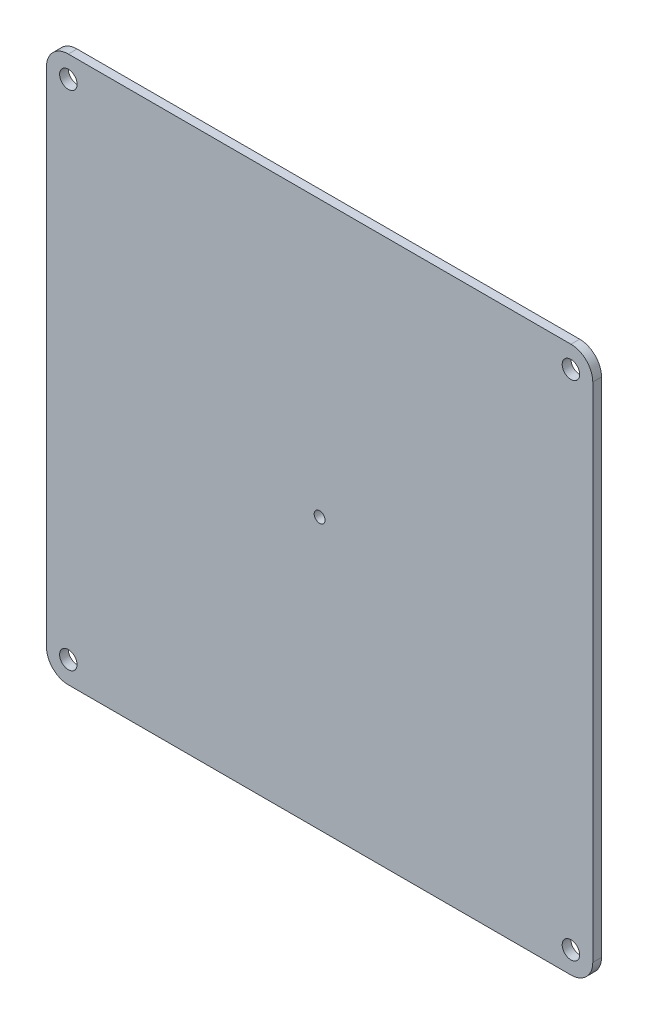
ISO-10303-21;
HEADER;
FILE_DESCRIPTION(('STEP AP214'),'2;1');
FILE_NAME('part.step','',(''),(''),'','','');
FILE_SCHEMA(('AUTOMOTIVE_DESIGN { 1 0 10303 214 1 1 1 1 }'));
ENDSEC;
DATA;
#1=APPLICATION_CONTEXT('core data for automotive mechanical design processes');
#2=APPLICATION_PROTOCOL_DEFINITION('international standard','automotive_design',2000,#1);
#3=PRODUCT_CONTEXT('',#1,'mechanical');
#4=PRODUCT('Part','Part','',(#3));
#5=PRODUCT_RELATED_PRODUCT_CATEGORY('part','',(#4));
#6=PRODUCT_DEFINITION_FORMATION('','',#4);
#7=PRODUCT_DEFINITION_CONTEXT('part definition',#1,'design');
#8=PRODUCT_DEFINITION('design','',#6,#7);
#9=PRODUCT_DEFINITION_SHAPE('','',#8);
#10=(LENGTH_UNIT() NAMED_UNIT(*) SI_UNIT(.MILLI.,.METRE.));
#11=(NAMED_UNIT(*) PLANE_ANGLE_UNIT() SI_UNIT($,.RADIAN.));
#12=(NAMED_UNIT(*) SI_UNIT($,.STERADIAN.) SOLID_ANGLE_UNIT());
#13=UNCERTAINTY_MEASURE_WITH_UNIT(LENGTH_MEASURE(1.E-05),#10,'distance_accuracy_value','');
#14=(GEOMETRIC_REPRESENTATION_CONTEXT(3) GLOBAL_UNCERTAINTY_ASSIGNED_CONTEXT((#13)) GLOBAL_UNIT_ASSIGNED_CONTEXT((#10,
#11,#12)) REPRESENTATION_CONTEXT('',''));
#15=CARTESIAN_POINT('',(0.,0.,0.));
#16=DIRECTION('',(0.,0.,1.));
#17=DIRECTION('',(1.,0.,0.));
#18=AXIS2_PLACEMENT_3D('',#15,#16,#17);
#19=CARTESIAN_POINT('',(46.0000000000003,46.0000000000005,1.6));
#20=DIRECTION('',(0.,0.,1.));
#21=DIRECTION('',(1.,0.,0.));
#22=AXIS2_PLACEMENT_3D('',#19,#20,#21);
#23=PLANE('',#22);
#24=CARTESIAN_POINT('',(45.9999999999998,-46.0000000000003,1.6));
#25=DIRECTION('',(0.,0.,1.));
#26=DIRECTION('',(1.,0.,0.));
#27=AXIS2_PLACEMENT_3D('',#24,#25,#26);
#28=CIRCLE('',#27,1.60000000000014);
#29=CARTESIAN_POINT('',(47.6,-46.0000000000003,1.6));
#30=VERTEX_POINT('',#29);
#31=EDGE_CURVE('E193',#30,#30,#28,.T.);
#32=ORIENTED_EDGE('',*,*,#31,.F.);
#33=EDGE_LOOP('',(#32));
#34=FACE_BOUND('',#33,.T.);
#35=CARTESIAN_POINT('',(0.,-0.4,1.6));
#36=DIRECTION('',(0.,0.,1.));
#37=DIRECTION('',(1.,0.,0.));
#38=AXIS2_PLACEMENT_3D('',#35,#36,#37);
#39=CIRCLE('',#38,1.);
#40=CARTESIAN_POINT('',(1.,-0.4,1.6));
#41=VERTEX_POINT('',#40);
#42=EDGE_CURVE('E181',#41,#41,#39,.T.);
#43=ORIENTED_EDGE('',*,*,#42,.F.);
#44=EDGE_LOOP('',(#43));
#45=FACE_BOUND('',#44,.T.);
#46=CARTESIAN_POINT('',(46.0000000000003,46.0000000000005,1.6));
#47=DIRECTION('',(0.,0.,1.));
#48=DIRECTION('',(1.,0.,0.));
#49=AXIS2_PLACEMENT_3D('',#46,#47,#48);
#50=CIRCLE('',#49,4.00000000000011);
#51=CARTESIAN_POINT('',(50.0000000000005,46.0000000000005,1.6));
#52=VERTEX_POINT('',#51);
#53=CARTESIAN_POINT('',(46.0000000000003,50.0000000000005,1.6));
#54=VERTEX_POINT('',#53);
#55=EDGE_CURVE('E144',#52,#54,#50,.T.);
#56=ORIENTED_EDGE('',*,*,#55,.T.);
#57=DIRECTION('',(-1.,0.,0.));
#58=VECTOR('',#57,1.);
#59=CARTESIAN_POINT('',(46.0000000000003,50.0000000000005,1.6));
#60=LINE('',#59,#58);
#61=CARTESIAN_POINT('',(-46.0000000000003,50.0000000000007,1.6));
#62=VERTEX_POINT('',#61);
#63=EDGE_CURVE('E92',#54,#62,#60,.T.);
#64=ORIENTED_EDGE('',*,*,#63,.T.);
#65=CARTESIAN_POINT('',(-46.0000000000005,46.0000000000009,1.6));
#66=DIRECTION('',(0.,0.,1.));
#67=DIRECTION('',(1.,0.,0.));
#68=AXIS2_PLACEMENT_3D('',#65,#66,#67);
#69=CIRCLE('',#68,3.99999999999978);
#70=CARTESIAN_POINT('',(-50.0000000000005,46.0000000000007,1.6));
#71=VERTEX_POINT('',#70);
#72=EDGE_CURVE('E159',#62,#71,#69,.T.);
#73=ORIENTED_EDGE('',*,*,#72,.T.);
#74=DIRECTION('',(0.,-1.,0.));
#75=VECTOR('',#74,1.);
#76=CARTESIAN_POINT('',(-50.0000000000005,-46.,1.6));
#77=LINE('',#76,#75);
#78=CARTESIAN_POINT('',(-50.0000000000004,-46.,1.6));
#79=VERTEX_POINT('',#78);
#80=EDGE_CURVE('E172',#71,#79,#77,.T.);
#81=ORIENTED_EDGE('',*,*,#80,.T.);
#82=CARTESIAN_POINT('',(-46.0000000000005,-46.,1.6));
#83=DIRECTION('',(0.,0.,1.));
#84=DIRECTION('',(-1.,0.,0.));
#85=AXIS2_PLACEMENT_3D('',#82,#83,#84);
#86=CIRCLE('',#85,3.99999999999989);
#87=CARTESIAN_POINT('',(-46.0000000000005,-49.9999999999998,1.6));
#88=VERTEX_POINT('',#87);
#89=EDGE_CURVE('E111',#79,#88,#86,.T.);
#90=ORIENTED_EDGE('',*,*,#89,.T.);
#91=DIRECTION('',(1.,0.,0.));
#92=VECTOR('',#91,1.);
#93=CARTESIAN_POINT('',(46.0000000000005,-49.9999999999998,1.6));
#94=LINE('',#93,#92);
#95=CARTESIAN_POINT('',(46.0000000000005,-49.9999999999998,1.6));
#96=VERTEX_POINT('',#95);
#97=EDGE_CURVE('E105',#88,#96,#94,.T.);
#98=ORIENTED_EDGE('',*,*,#97,.T.);
#99=CARTESIAN_POINT('',(46.0000000000005,-45.9999999999998,1.6));
#100=DIRECTION('',(0.,0.,1.));
#101=DIRECTION('',(1.,0.,0.));
#102=AXIS2_PLACEMENT_3D('',#99,#100,#101);
#103=CIRCLE('',#102,4.);
#104=CARTESIAN_POINT('',(50.0000000000005,-45.9999999999998,1.6));
#105=VERTEX_POINT('',#104);
#106=EDGE_CURVE('E109',#96,#105,#103,.T.);
#107=ORIENTED_EDGE('',*,*,#106,.T.);
#108=DIRECTION('',(0.,1.,0.));
#109=VECTOR('',#108,1.);
#110=CARTESIAN_POINT('',(50.0000000000005,-45.9999999999998,1.6));
#111=LINE('',#110,#109);
#112=EDGE_CURVE('E49',#105,#52,#111,.T.);
#113=ORIENTED_EDGE('',*,*,#112,.T.);
#114=EDGE_LOOP('',(#56,#64,#73,#81,#90,#98,#107,#113));
#115=FACE_BOUND('',#114,.T.);
#116=CARTESIAN_POINT('',(-46.,45.9999999999998,1.6));
#117=DIRECTION('',(0.,0.,1.));
#118=DIRECTION('',(1.,0.,0.));
#119=AXIS2_PLACEMENT_3D('',#116,#117,#118);
#120=CIRCLE('',#119,1.60000000000014);
#121=CARTESIAN_POINT('',(-44.3999999999999,45.9999999999998,1.6));
#122=VERTEX_POINT('',#121);
#123=EDGE_CURVE('E133',#122,#122,#120,.T.);
#124=ORIENTED_EDGE('',*,*,#123,.F.);
#125=EDGE_LOOP('',(#124));
#126=FACE_BOUND('',#125,.T.);
#127=CARTESIAN_POINT('',(45.9999999999998,45.9999999999998,1.6));
#128=DIRECTION('',(0.,0.,1.));
#129=DIRECTION('',(-1.,0.,0.));
#130=AXIS2_PLACEMENT_3D('',#127,#128,#129);
#131=CIRCLE('',#130,1.60000000000014);
#132=CARTESIAN_POINT('',(44.3999999999997,45.9999999999998,1.6));
#133=VERTEX_POINT('',#132);
#134=EDGE_CURVE('E187',#133,#133,#131,.T.);
#135=ORIENTED_EDGE('',*,*,#134,.F.);
#136=EDGE_LOOP('',(#135));
#137=FACE_BOUND('',#136,.T.);
#138=CARTESIAN_POINT('',(-46.,-46.0000000000003,1.6));
#139=DIRECTION('',(0.,0.,1.));
#140=DIRECTION('',(-1.,0.,0.));
#141=AXIS2_PLACEMENT_3D('',#138,#139,#140);
#142=CIRCLE('',#141,1.60000000000014);
#143=CARTESIAN_POINT('',(-47.6000000000002,-46.0000000000003,1.6));
#144=VERTEX_POINT('',#143);
#145=EDGE_CURVE('E199',#144,#144,#142,.T.);
#146=ORIENTED_EDGE('',*,*,#145,.F.);
#147=EDGE_LOOP('',(#146));
#148=FACE_BOUND('',#147,.T.);
#149=ADVANCED_FACE('F32',(#34,#45,#115,#126,#137,#148),#23,.T.);
#150=CARTESIAN_POINT('',(46.0000000000003,46.0000000000005,0.));
#151=DIRECTION('',(0.,0.,1.));
#152=DIRECTION('',(1.,0.,0.));
#153=AXIS2_PLACEMENT_3D('',#150,#151,#152);
#154=PLANE('',#153);
#155=CARTESIAN_POINT('',(45.9999999999998,-46.0000000000003,0.));
#156=DIRECTION('',(0.,0.,1.));
#157=DIRECTION('',(1.,0.,0.));
#158=AXIS2_PLACEMENT_3D('',#155,#156,#157);
#159=CIRCLE('',#158,1.60000000000014);
#160=CARTESIAN_POINT('',(47.6,-46.0000000000003,0.));
#161=VERTEX_POINT('',#160);
#162=EDGE_CURVE('E196',#161,#161,#159,.T.);
#163=ORIENTED_EDGE('',*,*,#162,.T.);
#164=EDGE_LOOP('',(#163));
#165=FACE_BOUND('',#164,.T.);
#166=CARTESIAN_POINT('',(0.,-0.4,0.));
#167=DIRECTION('',(0.,0.,1.));
#168=DIRECTION('',(1.,0.,0.));
#169=AXIS2_PLACEMENT_3D('',#166,#167,#168);
#170=CIRCLE('',#169,1.);
#171=CARTESIAN_POINT('',(1.,-0.4,0.));
#172=VERTEX_POINT('',#171);
#173=EDGE_CURVE('E184',#172,#172,#170,.T.);
#174=ORIENTED_EDGE('',*,*,#173,.T.);
#175=EDGE_LOOP('',(#174));
#176=FACE_BOUND('',#175,.T.);
#177=CARTESIAN_POINT('',(46.0000000000003,46.0000000000005,0.));
#178=DIRECTION('',(0.,0.,1.));
#179=DIRECTION('',(1.,0.,0.));
#180=AXIS2_PLACEMENT_3D('',#177,#178,#179);
#181=CIRCLE('',#180,4.00000000000011);
#182=CARTESIAN_POINT('',(50.0000000000005,46.0000000000005,0.));
#183=VERTEX_POINT('',#182);
#184=CARTESIAN_POINT('',(46.0000000000003,50.0000000000005,0.));
#185=VERTEX_POINT('',#184);
#186=EDGE_CURVE('E129',#183,#185,#181,.T.);
#187=ORIENTED_EDGE('',*,*,#186,.F.);
#188=DIRECTION('',(0.,1.,0.));
#189=VECTOR('',#188,1.);
#190=CARTESIAN_POINT('',(50.0000000000005,-45.9999999999998,0.));
#191=LINE('',#190,#189);
#192=CARTESIAN_POINT('',(50.0000000000005,-45.9999999999998,0.));
#193=VERTEX_POINT('',#192);
#194=EDGE_CURVE('E84',#193,#183,#191,.T.);
#195=ORIENTED_EDGE('',*,*,#194,.F.);
#196=CARTESIAN_POINT('',(46.0000000000005,-45.9999999999998,0.));
#197=DIRECTION('',(0.,0.,1.));
#198=DIRECTION('',(1.,0.,0.));
#199=AXIS2_PLACEMENT_3D('',#196,#197,#198);
#200=CIRCLE('',#199,4.);
#201=CARTESIAN_POINT('',(46.0000000000005,-49.9999999999998,0.));
#202=VERTEX_POINT('',#201);
#203=EDGE_CURVE('E78',#202,#193,#200,.T.);
#204=ORIENTED_EDGE('',*,*,#203,.F.);
#205=DIRECTION('',(1.,0.,0.));
#206=VECTOR('',#205,1.);
#207=CARTESIAN_POINT('',(46.0000000000005,-49.9999999999998,0.));
#208=LINE('',#207,#206);
#209=CARTESIAN_POINT('',(-46.0000000000005,-49.9999999999998,0.));
#210=VERTEX_POINT('',#209);
#211=EDGE_CURVE('E119',#210,#202,#208,.T.);
#212=ORIENTED_EDGE('',*,*,#211,.F.);
#213=CARTESIAN_POINT('',(-46.0000000000005,-46.,0.));
#214=DIRECTION('',(0.,0.,1.));
#215=DIRECTION('',(-1.,0.,0.));
#216=AXIS2_PLACEMENT_3D('',#213,#214,#215);
#217=CIRCLE('',#216,3.99999999999989);
#218=CARTESIAN_POINT('',(-50.0000000000004,-46.,0.));
#219=VERTEX_POINT('',#218);
#220=EDGE_CURVE('E139',#219,#210,#217,.T.);
#221=ORIENTED_EDGE('',*,*,#220,.F.);
#222=DIRECTION('',(0.,-1.,0.));
#223=VECTOR('',#222,1.);
#224=CARTESIAN_POINT('',(-50.0000000000005,-46.,0.));
#225=LINE('',#224,#223);
#226=CARTESIAN_POINT('',(-50.0000000000005,46.0000000000007,0.));
#227=VERTEX_POINT('',#226);
#228=EDGE_CURVE('E137',#227,#219,#225,.T.);
#229=ORIENTED_EDGE('',*,*,#228,.F.);
#230=CARTESIAN_POINT('',(-46.0000000000005,46.0000000000009,0.));
#231=DIRECTION('',(0.,0.,1.));
#232=DIRECTION('',(1.,0.,0.));
#233=AXIS2_PLACEMENT_3D('',#230,#231,#232);
#234=CIRCLE('',#233,3.99999999999978);
#235=CARTESIAN_POINT('',(-46.0000000000003,50.0000000000007,0.));
#236=VERTEX_POINT('',#235);
#237=EDGE_CURVE('E135',#236,#227,#234,.T.);
#238=ORIENTED_EDGE('',*,*,#237,.F.);
#239=DIRECTION('',(-1.,0.,0.));
#240=VECTOR('',#239,1.);
#241=CARTESIAN_POINT('',(46.0000000000003,50.0000000000005,0.));
#242=LINE('',#241,#240);
#243=EDGE_CURVE('E132',#185,#236,#242,.T.);
#244=ORIENTED_EDGE('',*,*,#243,.F.);
#245=EDGE_LOOP('',(#187,#195,#204,#212,#221,#229,#238,#244));
#246=FACE_BOUND('',#245,.T.);
#247=CARTESIAN_POINT('',(-46.,45.9999999999998,0.));
#248=DIRECTION('',(0.,0.,1.));
#249=DIRECTION('',(1.,0.,0.));
#250=AXIS2_PLACEMENT_3D('',#247,#248,#249);
#251=CIRCLE('',#250,1.60000000000014);
#252=CARTESIAN_POINT('',(-44.3999999999999,45.9999999999998,0.));
#253=VERTEX_POINT('',#252);
#254=EDGE_CURVE('E178',#253,#253,#251,.T.);
#255=ORIENTED_EDGE('',*,*,#254,.T.);
#256=EDGE_LOOP('',(#255));
#257=FACE_BOUND('',#256,.T.);
#258=CARTESIAN_POINT('',(45.9999999999998,45.9999999999998,0.));
#259=DIRECTION('',(0.,0.,1.));
#260=DIRECTION('',(-1.,0.,0.));
#261=AXIS2_PLACEMENT_3D('',#258,#259,#260);
#262=CIRCLE('',#261,1.60000000000014);
#263=CARTESIAN_POINT('',(44.3999999999997,45.9999999999998,0.));
#264=VERTEX_POINT('',#263);
#265=EDGE_CURVE('E190',#264,#264,#262,.T.);
#266=ORIENTED_EDGE('',*,*,#265,.T.);
#267=EDGE_LOOP('',(#266));
#268=FACE_BOUND('',#267,.T.);
#269=CARTESIAN_POINT('',(-46.,-46.0000000000003,0.));
#270=DIRECTION('',(0.,0.,1.));
#271=DIRECTION('',(-1.,0.,0.));
#272=AXIS2_PLACEMENT_3D('',#269,#270,#271);
#273=CIRCLE('',#272,1.60000000000014);
#274=CARTESIAN_POINT('',(-47.6000000000002,-46.0000000000003,0.));
#275=VERTEX_POINT('',#274);
#276=EDGE_CURVE('E202',#275,#275,#273,.T.);
#277=ORIENTED_EDGE('',*,*,#276,.T.);
#278=EDGE_LOOP('',(#277));
#279=FACE_BOUND('',#278,.T.);
#280=ADVANCED_FACE('F163',(#165,#176,#246,#257,#268,#279),#154,.F.);
#281=CARTESIAN_POINT('',(46.0000000000003,46.0000000000005,1.6));
#282=DIRECTION('',(0.,0.,-1.));
#283=DIRECTION('',(-1.,0.,0.));
#284=AXIS2_PLACEMENT_3D('',#281,#282,#283);
#285=CYLINDRICAL_SURFACE('',#284,4.00000000000011);
#286=ORIENTED_EDGE('',*,*,#186,.T.);
#287=DIRECTION('',(0.,0.,-1.));
#288=VECTOR('',#287,1.);
#289=CARTESIAN_POINT('',(46.0000000000003,50.0000000000005,1.6));
#290=LINE('',#289,#288);
#291=EDGE_CURVE('E11',#54,#185,#290,.T.);
#292=ORIENTED_EDGE('',*,*,#291,.F.);
#293=ORIENTED_EDGE('',*,*,#55,.F.);
#294=DIRECTION('',(0.,0.,-1.));
#295=VECTOR('',#294,1.);
#296=CARTESIAN_POINT('',(50.0000000000005,46.0000000000005,1.6));
#297=LINE('',#296,#295);
#298=EDGE_CURVE('E125',#52,#183,#297,.T.);
#299=ORIENTED_EDGE('',*,*,#298,.T.);
#300=EDGE_LOOP('',(#286,#292,#293,#299));
#301=FACE_BOUND('',#300,.T.);
#302=ADVANCED_FACE('F34',(#301),#285,.T.);
#303=CARTESIAN_POINT('',(46.0000000000003,50.0000000000005,1.6));
#304=DIRECTION('',(0.,-1.,0.));
#305=DIRECTION('',(0.,0.,-1.));
#306=AXIS2_PLACEMENT_3D('',#303,#304,#305);
#307=PLANE('',#306);
#308=ORIENTED_EDGE('',*,*,#243,.T.);
#309=DIRECTION('',(0.,0.,-1.));
#310=VECTOR('',#309,1.);
#311=CARTESIAN_POINT('',(-46.0000000000003,50.0000000000007,1.6));
#312=LINE('',#311,#310);
#313=EDGE_CURVE('E41',#62,#236,#312,.T.);
#314=ORIENTED_EDGE('',*,*,#313,.F.);
#315=ORIENTED_EDGE('',*,*,#63,.F.);
#316=ORIENTED_EDGE('',*,*,#291,.T.);
#317=EDGE_LOOP('',(#308,#314,#315,#316));
#318=FACE_BOUND('',#317,.T.);
#319=ADVANCED_FACE('F237',(#318),#307,.F.);
#320=CARTESIAN_POINT('',(-46.0000000000005,46.0000000000009,1.6));
#321=DIRECTION('',(0.,0.,-1.));
#322=DIRECTION('',(-1.,0.,0.));
#323=AXIS2_PLACEMENT_3D('',#320,#321,#322);
#324=CYLINDRICAL_SURFACE('',#323,3.99999999999978);
#325=ORIENTED_EDGE('',*,*,#237,.T.);
#326=DIRECTION('',(0.,0.,-1.));
#327=VECTOR('',#326,1.);
#328=CARTESIAN_POINT('',(-50.0000000000005,46.0000000000007,1.6));
#329=LINE('',#328,#327);
#330=EDGE_CURVE('E151',#71,#227,#329,.T.);
#331=ORIENTED_EDGE('',*,*,#330,.F.);
#332=ORIENTED_EDGE('',*,*,#72,.F.);
#333=ORIENTED_EDGE('',*,*,#313,.T.);
#334=EDGE_LOOP('',(#325,#331,#332,#333));
#335=FACE_BOUND('',#334,.T.);
#336=ADVANCED_FACE('F157',(#335),#324,.T.);
#337=CARTESIAN_POINT('',(-50.0000000000005,-46.,1.6));
#338=DIRECTION('',(1.,0.,0.));
#339=DIRECTION('',(0.,0.,-1.));
#340=AXIS2_PLACEMENT_3D('',#337,#338,#339);
#341=PLANE('',#340);
#342=ORIENTED_EDGE('',*,*,#228,.T.);
#343=DIRECTION('',(0.,0.,-1.));
#344=VECTOR('',#343,1.);
#345=CARTESIAN_POINT('',(-50.0000000000004,-46.,1.6));
#346=LINE('',#345,#344);
#347=EDGE_CURVE('E148',#79,#219,#346,.T.);
#348=ORIENTED_EDGE('',*,*,#347,.F.);
#349=ORIENTED_EDGE('',*,*,#80,.F.);
#350=ORIENTED_EDGE('',*,*,#330,.T.);
#351=EDGE_LOOP('',(#342,#348,#349,#350));
#352=FACE_BOUND('',#351,.T.);
#353=ADVANCED_FACE('F168',(#352),#341,.F.);
#354=CARTESIAN_POINT('',(-46.0000000000005,-46.,1.6));
#355=DIRECTION('',(0.,0.,-1.));
#356=DIRECTION('',(-1.,0.,0.));
#357=AXIS2_PLACEMENT_3D('',#354,#355,#356);
#358=CYLINDRICAL_SURFACE('',#357,3.99999999999989);
#359=ORIENTED_EDGE('',*,*,#220,.T.);
#360=DIRECTION('',(0.,0.,-1.));
#361=VECTOR('',#360,1.);
#362=CARTESIAN_POINT('',(-46.0000000000005,-49.9999999999998,1.6));
#363=LINE('',#362,#361);
#364=EDGE_CURVE('E120',#88,#210,#363,.T.);
#365=ORIENTED_EDGE('',*,*,#364,.F.);
#366=ORIENTED_EDGE('',*,*,#89,.F.);
#367=ORIENTED_EDGE('',*,*,#347,.T.);
#368=EDGE_LOOP('',(#359,#365,#366,#367));
#369=FACE_BOUND('',#368,.T.);
#370=ADVANCED_FACE('F171',(#369),#358,.T.);
#371=CARTESIAN_POINT('',(46.0000000000005,-49.9999999999998,1.6));
#372=DIRECTION('',(0.,1.,0.));
#373=DIRECTION('',(0.,0.,1.));
#374=AXIS2_PLACEMENT_3D('',#371,#372,#373);
#375=PLANE('',#374);
#376=ORIENTED_EDGE('',*,*,#211,.T.);
#377=DIRECTION('',(0.,0.,-1.));
#378=VECTOR('',#377,1.);
#379=CARTESIAN_POINT('',(46.0000000000005,-49.9999999999998,1.6));
#380=LINE('',#379,#378);
#381=EDGE_CURVE('E116',#96,#202,#380,.T.);
#382=ORIENTED_EDGE('',*,*,#381,.F.);
#383=ORIENTED_EDGE('',*,*,#97,.F.);
#384=ORIENTED_EDGE('',*,*,#364,.T.);
#385=EDGE_LOOP('',(#376,#382,#383,#384));
#386=FACE_BOUND('',#385,.T.);
#387=ADVANCED_FACE('F117',(#386),#375,.F.);
#388=CARTESIAN_POINT('',(46.0000000000005,-45.9999999999998,1.6));
#389=DIRECTION('',(0.,0.,-1.));
#390=DIRECTION('',(-1.,0.,0.));
#391=AXIS2_PLACEMENT_3D('',#388,#389,#390);
#392=CYLINDRICAL_SURFACE('',#391,4.);
#393=ORIENTED_EDGE('',*,*,#203,.T.);
#394=DIRECTION('',(0.,0.,-1.));
#395=VECTOR('',#394,1.);
#396=CARTESIAN_POINT('',(50.0000000000005,-45.9999999999998,1.6));
#397=LINE('',#396,#395);
#398=EDGE_CURVE('E121',#105,#193,#397,.T.);
#399=ORIENTED_EDGE('',*,*,#398,.F.);
#400=ORIENTED_EDGE('',*,*,#106,.F.);
#401=ORIENTED_EDGE('',*,*,#381,.T.);
#402=EDGE_LOOP('',(#393,#399,#400,#401));
#403=FACE_BOUND('',#402,.T.);
#404=ADVANCED_FACE('F123',(#403),#392,.T.);
#405=CARTESIAN_POINT('',(50.0000000000005,-45.9999999999998,1.6));
#406=DIRECTION('',(-1.,0.,0.));
#407=DIRECTION('',(0.,0.,1.));
#408=AXIS2_PLACEMENT_3D('',#405,#406,#407);
#409=PLANE('',#408);
#410=ORIENTED_EDGE('',*,*,#194,.T.);
#411=ORIENTED_EDGE('',*,*,#298,.F.);
#412=ORIENTED_EDGE('',*,*,#112,.F.);
#413=ORIENTED_EDGE('',*,*,#398,.T.);
#414=EDGE_LOOP('',(#410,#411,#412,#413));
#415=FACE_BOUND('',#414,.T.);
#416=ADVANCED_FACE('F225',(#415),#409,.F.);
#417=CARTESIAN_POINT('',(-46.,45.9999999999998,1.6));
#418=DIRECTION('',(0.,0.,-1.));
#419=DIRECTION('',(-1.,0.,0.));
#420=AXIS2_PLACEMENT_3D('',#417,#418,#419);
#421=CYLINDRICAL_SURFACE('',#420,1.60000000000014);
#422=ORIENTED_EDGE('',*,*,#123,.T.);
#423=EDGE_LOOP('',(#422));
#424=FACE_BOUND('',#423,.T.);
#425=ORIENTED_EDGE('',*,*,#254,.F.);
#426=EDGE_LOOP('',(#425));
#427=FACE_BOUND('',#426,.T.);
#428=ADVANCED_FACE('F222',(#424,#427),#421,.F.);
#429=CARTESIAN_POINT('',(0.,-0.4,1.6));
#430=DIRECTION('',(0.,0.,-1.));
#431=DIRECTION('',(-1.,0.,0.));
#432=AXIS2_PLACEMENT_3D('',#429,#430,#431);
#433=CYLINDRICAL_SURFACE('',#432,1.);
#434=ORIENTED_EDGE('',*,*,#42,.T.);
#435=EDGE_LOOP('',(#434));
#436=FACE_BOUND('',#435,.T.);
#437=ORIENTED_EDGE('',*,*,#173,.F.);
#438=EDGE_LOOP('',(#437));
#439=FACE_BOUND('',#438,.T.);
#440=ADVANCED_FACE('F301',(#436,#439),#433,.F.);
#441=CARTESIAN_POINT('',(45.9999999999998,45.9999999999998,1.6));
#442=DIRECTION('',(0.,0.,-1.));
#443=DIRECTION('',(-1.,0.,0.));
#444=AXIS2_PLACEMENT_3D('',#441,#442,#443);
#445=CYLINDRICAL_SURFACE('',#444,1.60000000000014);
#446=ORIENTED_EDGE('',*,*,#134,.T.);
#447=EDGE_LOOP('',(#446));
#448=FACE_BOUND('',#447,.T.);
#449=ORIENTED_EDGE('',*,*,#265,.F.);
#450=EDGE_LOOP('',(#449));
#451=FACE_BOUND('',#450,.T.);
#452=ADVANCED_FACE('F309',(#448,#451),#445,.F.);
#453=CARTESIAN_POINT('',(45.9999999999998,-46.0000000000003,1.6));
#454=DIRECTION('',(0.,0.,-1.));
#455=DIRECTION('',(-1.,0.,0.));
#456=AXIS2_PLACEMENT_3D('',#453,#454,#455);
#457=CYLINDRICAL_SURFACE('',#456,1.60000000000014);
#458=ORIENTED_EDGE('',*,*,#31,.T.);
#459=EDGE_LOOP('',(#458));
#460=FACE_BOUND('',#459,.T.);
#461=ORIENTED_EDGE('',*,*,#162,.F.);
#462=EDGE_LOOP('',(#461));
#463=FACE_BOUND('',#462,.T.);
#464=ADVANCED_FACE('F317',(#460,#463),#457,.F.);
#465=CARTESIAN_POINT('',(-46.,-46.0000000000003,1.6));
#466=DIRECTION('',(0.,0.,-1.));
#467=DIRECTION('',(-1.,0.,0.));
#468=AXIS2_PLACEMENT_3D('',#465,#466,#467);
#469=CYLINDRICAL_SURFACE('',#468,1.60000000000014);
#470=ORIENTED_EDGE('',*,*,#145,.T.);
#471=EDGE_LOOP('',(#470));
#472=FACE_BOUND('',#471,.T.);
#473=ORIENTED_EDGE('',*,*,#276,.F.);
#474=EDGE_LOOP('',(#473));
#475=FACE_BOUND('',#474,.T.);
#476=ADVANCED_FACE('F208',(#472,#475),#469,.F.);
#477=CLOSED_SHELL('',(#149,#280,#302,#319,#336,#353,#370,#387,#404,#416,#428,#440,#452,#464,#476));
#478=MANIFOLD_SOLID_BREP('B2',#477);
#479=ADVANCED_BREP_SHAPE_REPRESENTATION('',(#18,#478),#14);
#480=SHAPE_DEFINITION_REPRESENTATION(#9,#479);
ENDSEC;
END-ISO-10303-21;
